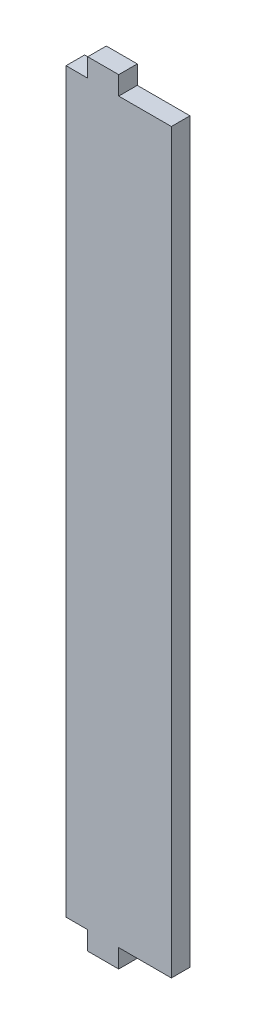
ISO-10303-21;
HEADER;
FILE_DESCRIPTION(('STEP AP214'),'2;1');
FILE_NAME('part.step','',(''),(''),'','','');
FILE_SCHEMA(('AUTOMOTIVE_DESIGN { 1 0 10303 214 1 1 1 1 }'));
ENDSEC;
DATA;
#1=APPLICATION_CONTEXT('core data for automotive mechanical design processes');
#2=APPLICATION_PROTOCOL_DEFINITION('international standard','automotive_design',2000,#1);
#3=PRODUCT_CONTEXT('',#1,'mechanical');
#4=PRODUCT('Part','Part','',(#3));
#5=PRODUCT_RELATED_PRODUCT_CATEGORY('part','',(#4));
#6=PRODUCT_DEFINITION_FORMATION('','',#4);
#7=PRODUCT_DEFINITION_CONTEXT('part definition',#1,'design');
#8=PRODUCT_DEFINITION('design','',#6,#7);
#9=PRODUCT_DEFINITION_SHAPE('','',#8);
#10=(LENGTH_UNIT() NAMED_UNIT(*) SI_UNIT(.MILLI.,.METRE.));
#11=(NAMED_UNIT(*) PLANE_ANGLE_UNIT() SI_UNIT($,.RADIAN.));
#12=(NAMED_UNIT(*) SI_UNIT($,.STERADIAN.) SOLID_ANGLE_UNIT());
#13=UNCERTAINTY_MEASURE_WITH_UNIT(LENGTH_MEASURE(1.E-05),#10,'distance_accuracy_value','');
#14=(GEOMETRIC_REPRESENTATION_CONTEXT(3) GLOBAL_UNCERTAINTY_ASSIGNED_CONTEXT((#13)) GLOBAL_UNIT_ASSIGNED_CONTEXT((#10,
#11,#12)) REPRESENTATION_CONTEXT('',''));
#15=CARTESIAN_POINT('',(0.,0.,0.));
#16=DIRECTION('',(0.,0.,1.));
#17=DIRECTION('',(1.,0.,0.));
#18=AXIS2_PLACEMENT_3D('',#15,#16,#17);
#19=CARTESIAN_POINT('',(-17.,-119.,6.));
#20=DIRECTION('',(0.,1.,0.));
#21=DIRECTION('',(0.,0.,1.));
#22=AXIS2_PLACEMENT_3D('',#19,#20,#21);
#23=PLANE('',#22);
#24=DIRECTION('',(0.,0.,1.));
#25=VECTOR('',#24,1.);
#26=CARTESIAN_POINT('',(0.,-119.,0.));
#27=LINE('',#26,#25);
#28=CARTESIAN_POINT('',(0.,-119.,0.));
#29=VERTEX_POINT('',#28);
#30=CARTESIAN_POINT('',(0.,-119.,6.));
#31=VERTEX_POINT('',#30);
#32=EDGE_CURVE('E243',#29,#31,#27,.T.);
#33=ORIENTED_EDGE('',*,*,#32,.F.);
#34=DIRECTION('',(1.,0.,0.));
#35=VECTOR('',#34,1.);
#36=CARTESIAN_POINT('',(-17.,-119.,0.));
#37=LINE('',#36,#35);
#38=CARTESIAN_POINT('',(17.,-119.,0.));
#39=VERTEX_POINT('',#38);
#40=EDGE_CURVE('E146',#29,#39,#37,.T.);
#41=ORIENTED_EDGE('',*,*,#40,.T.);
#42=DIRECTION('',(0.,0.,-1.));
#43=VECTOR('',#42,1.);
#44=CARTESIAN_POINT('',(17.,-119.,6.));
#45=LINE('',#44,#43);
#46=CARTESIAN_POINT('',(17.,-119.,6.));
#47=VERTEX_POINT('',#46);
#48=EDGE_CURVE('E42',#47,#39,#45,.T.);
#49=ORIENTED_EDGE('',*,*,#48,.F.);
#50=DIRECTION('',(1.,0.,0.));
#51=VECTOR('',#50,1.);
#52=CARTESIAN_POINT('',(-17.,-119.,6.));
#53=LINE('',#52,#51);
#54=EDGE_CURVE('E202',#31,#47,#53,.T.);
#55=ORIENTED_EDGE('',*,*,#54,.F.);
#56=EDGE_LOOP('',(#33,#41,#49,#55));
#57=FACE_BOUND('',#56,.T.);
#58=ADVANCED_FACE('F33',(#57),#23,.F.);
#59=CARTESIAN_POINT('',(-17.,119.,6.));
#60=DIRECTION('',(0.,-1.,0.));
#61=DIRECTION('',(0.,0.,-1.));
#62=AXIS2_PLACEMENT_3D('',#59,#60,#61);
#63=PLANE('',#62);
#64=DIRECTION('',(0.,0.,1.));
#65=VECTOR('',#64,1.);
#66=CARTESIAN_POINT('',(-10.,119.,0.));
#67=LINE('',#66,#65);
#68=CARTESIAN_POINT('',(-10.,119.,0.));
#69=VERTEX_POINT('',#68);
#70=CARTESIAN_POINT('',(-10.,119.,6.));
#71=VERTEX_POINT('',#70);
#72=EDGE_CURVE('E230',#69,#71,#67,.T.);
#73=ORIENTED_EDGE('',*,*,#72,.F.);
#74=DIRECTION('',(-1.,0.,0.));
#75=VECTOR('',#74,1.);
#76=CARTESIAN_POINT('',(-17.,119.,0.));
#77=LINE('',#76,#75);
#78=CARTESIAN_POINT('',(-17.,119.,0.));
#79=VERTEX_POINT('',#78);
#80=EDGE_CURVE('E148',#69,#79,#77,.T.);
#81=ORIENTED_EDGE('',*,*,#80,.T.);
#82=DIRECTION('',(0.,0.,-1.));
#83=VECTOR('',#82,1.);
#84=CARTESIAN_POINT('',(-17.,119.,6.));
#85=LINE('',#84,#83);
#86=CARTESIAN_POINT('',(-17.,119.,6.));
#87=VERTEX_POINT('',#86);
#88=EDGE_CURVE('E164',#87,#79,#85,.T.);
#89=ORIENTED_EDGE('',*,*,#88,.F.);
#90=DIRECTION('',(-1.,0.,0.));
#91=VECTOR('',#90,1.);
#92=CARTESIAN_POINT('',(-17.,119.,6.));
#93=LINE('',#92,#91);
#94=EDGE_CURVE('E187',#71,#87,#93,.T.);
#95=ORIENTED_EDGE('',*,*,#94,.F.);
#96=EDGE_LOOP('',(#73,#81,#89,#95));
#97=FACE_BOUND('',#96,.T.);
#98=ADVANCED_FACE('F293',(#97),#63,.F.);
#99=CARTESIAN_POINT('',(-17.,119.,6.));
#100=DIRECTION('',(1.,0.,0.));
#101=DIRECTION('',(0.,1.,0.));
#102=AXIS2_PLACEMENT_3D('',#99,#100,#101);
#103=PLANE('',#102);
#104=DIRECTION('',(0.,-1.,0.));
#105=VECTOR('',#104,1.);
#106=CARTESIAN_POINT('',(-17.,119.,0.));
#107=LINE('',#106,#105);
#108=CARTESIAN_POINT('',(-17.,-119.,0.));
#109=VERTEX_POINT('',#108);
#110=EDGE_CURVE('E150',#79,#109,#107,.T.);
#111=ORIENTED_EDGE('',*,*,#110,.T.);
#112=DIRECTION('',(0.,0.,-1.));
#113=VECTOR('',#112,1.);
#114=CARTESIAN_POINT('',(-17.,-119.,6.));
#115=LINE('',#114,#113);
#116=CARTESIAN_POINT('',(-17.,-119.,6.));
#117=VERTEX_POINT('',#116);
#118=EDGE_CURVE('E11',#117,#109,#115,.T.);
#119=ORIENTED_EDGE('',*,*,#118,.F.);
#120=DIRECTION('',(0.,-1.,0.));
#121=VECTOR('',#120,1.);
#122=CARTESIAN_POINT('',(-17.,119.,6.));
#123=LINE('',#122,#121);
#124=EDGE_CURVE('E172',#87,#117,#123,.T.);
#125=ORIENTED_EDGE('',*,*,#124,.F.);
#126=ORIENTED_EDGE('',*,*,#88,.T.);
#127=EDGE_LOOP('',(#111,#119,#125,#126));
#128=FACE_BOUND('',#127,.T.);
#129=ADVANCED_FACE('F35',(#128),#103,.F.);
#130=CARTESIAN_POINT('',(-9.99999999999999,-119.,0.));
#131=VERTEX_POINT('',#130);
#132=EDGE_CURVE('E136',#109,#131,#37,.T.);
#133=ORIENTED_EDGE('',*,*,#132,.T.);
#134=DIRECTION('',(0.,0.,1.));
#135=VECTOR('',#134,1.);
#136=CARTESIAN_POINT('',(-9.99999999999999,-119.,0.));
#137=LINE('',#136,#135);
#138=CARTESIAN_POINT('',(-9.99999999999999,-119.,6.));
#139=VERTEX_POINT('',#138);
#140=EDGE_CURVE('E122',#131,#139,#137,.T.);
#141=ORIENTED_EDGE('',*,*,#140,.T.);
#142=EDGE_CURVE('E196',#117,#139,#53,.T.);
#143=ORIENTED_EDGE('',*,*,#142,.F.);
#144=ORIENTED_EDGE('',*,*,#118,.T.);
#145=EDGE_LOOP('',(#133,#141,#143,#144));
#146=FACE_BOUND('',#145,.T.);
#147=ADVANCED_FACE('F142',(#146),#23,.F.);
#148=CARTESIAN_POINT('',(17.,119.,6.));
#149=DIRECTION('',(-1.,0.,0.));
#150=DIRECTION('',(0.,-1.,0.));
#151=AXIS2_PLACEMENT_3D('',#148,#149,#150);
#152=PLANE('',#151);
#153=DIRECTION('',(0.,1.,0.));
#154=VECTOR('',#153,1.);
#155=CARTESIAN_POINT('',(17.,119.,0.));
#156=LINE('',#155,#154);
#157=CARTESIAN_POINT('',(17.,119.,0.));
#158=VERTEX_POINT('',#157);
#159=EDGE_CURVE('E145',#39,#158,#156,.T.);
#160=ORIENTED_EDGE('',*,*,#159,.T.);
#161=DIRECTION('',(0.,0.,-1.));
#162=VECTOR('',#161,1.);
#163=CARTESIAN_POINT('',(17.,119.,6.));
#164=LINE('',#163,#162);
#165=CARTESIAN_POINT('',(17.,119.,6.));
#166=VERTEX_POINT('',#165);
#167=EDGE_CURVE('E175',#166,#158,#164,.T.);
#168=ORIENTED_EDGE('',*,*,#167,.F.);
#169=DIRECTION('',(0.,1.,0.));
#170=VECTOR('',#169,1.);
#171=CARTESIAN_POINT('',(17.,119.,6.));
#172=LINE('',#171,#170);
#173=EDGE_CURVE('E189',#47,#166,#172,.T.);
#174=ORIENTED_EDGE('',*,*,#173,.F.);
#175=ORIENTED_EDGE('',*,*,#48,.T.);
#176=EDGE_LOOP('',(#160,#168,#174,#175));
#177=FACE_BOUND('',#176,.T.);
#178=ADVANCED_FACE('F273',(#177),#152,.F.);
#179=CARTESIAN_POINT('',(0.,119.,0.));
#180=VERTEX_POINT('',#179);
#181=EDGE_CURVE('E170',#158,#180,#77,.T.);
#182=ORIENTED_EDGE('',*,*,#181,.T.);
#183=DIRECTION('',(0.,0.,1.));
#184=VECTOR('',#183,1.);
#185=CARTESIAN_POINT('',(0.,119.,0.));
#186=LINE('',#185,#184);
#187=CARTESIAN_POINT('',(0.,119.,6.));
#188=VERTEX_POINT('',#187);
#189=EDGE_CURVE('E219',#180,#188,#186,.T.);
#190=ORIENTED_EDGE('',*,*,#189,.T.);
#191=EDGE_CURVE('E182',#166,#188,#93,.T.);
#192=ORIENTED_EDGE('',*,*,#191,.F.);
#193=ORIENTED_EDGE('',*,*,#167,.T.);
#194=EDGE_LOOP('',(#182,#190,#192,#193));
#195=FACE_BOUND('',#194,.T.);
#196=ADVANCED_FACE('F274',(#195),#63,.F.);
#197=CARTESIAN_POINT('',(0.,0.,6.));
#198=DIRECTION('',(0.,0.,1.));
#199=DIRECTION('',(1.,0.,0.));
#200=AXIS2_PLACEMENT_3D('',#197,#198,#199);
#201=PLANE('',#200);
#202=ORIENTED_EDGE('',*,*,#124,.T.);
#203=ORIENTED_EDGE('',*,*,#142,.T.);
#204=DIRECTION('',(0.,-1.,0.));
#205=VECTOR('',#204,1.);
#206=CARTESIAN_POINT('',(-9.99999999999999,-119.,6.));
#207=LINE('',#206,#205);
#208=CARTESIAN_POINT('',(-9.99999999999998,-125.,6.));
#209=VERTEX_POINT('',#208);
#210=EDGE_CURVE('E50',#139,#209,#207,.T.);
#211=ORIENTED_EDGE('',*,*,#210,.T.);
#212=DIRECTION('',(1.,0.,0.));
#213=VECTOR('',#212,1.);
#214=CARTESIAN_POINT('',(-9.99999999999998,-125.,6.));
#215=LINE('',#214,#213);
#216=CARTESIAN_POINT('',(0.,-125.,6.));
#217=VERTEX_POINT('',#216);
#218=EDGE_CURVE('E258',#209,#217,#215,.T.);
#219=ORIENTED_EDGE('',*,*,#218,.T.);
#220=DIRECTION('',(0.,1.,0.));
#221=VECTOR('',#220,1.);
#222=CARTESIAN_POINT('',(0.,-119.,6.));
#223=LINE('',#222,#221);
#224=EDGE_CURVE('E140',#217,#31,#223,.T.);
#225=ORIENTED_EDGE('',*,*,#224,.T.);
#226=ORIENTED_EDGE('',*,*,#54,.T.);
#227=ORIENTED_EDGE('',*,*,#173,.T.);
#228=ORIENTED_EDGE('',*,*,#191,.T.);
#229=DIRECTION('',(0.,1.,0.));
#230=VECTOR('',#229,1.);
#231=CARTESIAN_POINT('',(0.,119.,6.));
#232=LINE('',#231,#230);
#233=CARTESIAN_POINT('',(0.,125.,6.));
#234=VERTEX_POINT('',#233);
#235=EDGE_CURVE('E58',#188,#234,#232,.T.);
#236=ORIENTED_EDGE('',*,*,#235,.T.);
#237=DIRECTION('',(-1.,0.,0.));
#238=VECTOR('',#237,1.);
#239=CARTESIAN_POINT('',(-10.,125.,6.));
#240=LINE('',#239,#238);
#241=CARTESIAN_POINT('',(-10.,125.,6.));
#242=VERTEX_POINT('',#241);
#243=EDGE_CURVE('E222',#234,#242,#240,.T.);
#244=ORIENTED_EDGE('',*,*,#243,.T.);
#245=DIRECTION('',(0.,-1.,0.));
#246=VECTOR('',#245,1.);
#247=CARTESIAN_POINT('',(-10.,119.,6.));
#248=LINE('',#247,#246);
#249=EDGE_CURVE('E242',#242,#71,#248,.T.);
#250=ORIENTED_EDGE('',*,*,#249,.T.);
#251=ORIENTED_EDGE('',*,*,#94,.T.);
#252=EDGE_LOOP('',(#202,#203,#211,#219,#225,#226,#227,#228,#236,#244,#250,#251));
#253=FACE_BOUND('',#252,.T.);
#254=ADVANCED_FACE('F208',(#253),#201,.T.);
#255=CARTESIAN_POINT('',(0.,0.,0.));
#256=DIRECTION('',(0.,0.,1.));
#257=DIRECTION('',(1.,0.,0.));
#258=AXIS2_PLACEMENT_3D('',#255,#256,#257);
#259=PLANE('',#258);
#260=ORIENTED_EDGE('',*,*,#110,.F.);
#261=ORIENTED_EDGE('',*,*,#80,.F.);
#262=DIRECTION('',(0.,-1.,0.));
#263=VECTOR('',#262,1.);
#264=CARTESIAN_POINT('',(-10.,119.,0.));
#265=LINE('',#264,#263);
#266=CARTESIAN_POINT('',(-10.,125.,0.));
#267=VERTEX_POINT('',#266);
#268=EDGE_CURVE('E236',#267,#69,#265,.T.);
#269=ORIENTED_EDGE('',*,*,#268,.F.);
#270=DIRECTION('',(-1.,0.,0.));
#271=VECTOR('',#270,1.);
#272=CARTESIAN_POINT('',(-10.,125.,0.));
#273=LINE('',#272,#271);
#274=CARTESIAN_POINT('',(0.,125.,0.));
#275=VERTEX_POINT('',#274);
#276=EDGE_CURVE('E235',#275,#267,#273,.T.);
#277=ORIENTED_EDGE('',*,*,#276,.F.);
#278=DIRECTION('',(0.,1.,0.));
#279=VECTOR('',#278,1.);
#280=CARTESIAN_POINT('',(0.,119.,0.));
#281=LINE('',#280,#279);
#282=EDGE_CURVE('E232',#180,#275,#281,.T.);
#283=ORIENTED_EDGE('',*,*,#282,.F.);
#284=ORIENTED_EDGE('',*,*,#181,.F.);
#285=ORIENTED_EDGE('',*,*,#159,.F.);
#286=ORIENTED_EDGE('',*,*,#40,.F.);
#287=DIRECTION('',(0.,1.,0.));
#288=VECTOR('',#287,1.);
#289=CARTESIAN_POINT('',(0.,-119.,0.));
#290=LINE('',#289,#288);
#291=CARTESIAN_POINT('',(0.,-125.,0.));
#292=VERTEX_POINT('',#291);
#293=EDGE_CURVE('E130',#292,#29,#290,.T.);
#294=ORIENTED_EDGE('',*,*,#293,.F.);
#295=DIRECTION('',(1.,0.,0.));
#296=VECTOR('',#295,1.);
#297=CARTESIAN_POINT('',(-9.99999999999998,-125.,0.));
#298=LINE('',#297,#296);
#299=CARTESIAN_POINT('',(-9.99999999999998,-125.,0.));
#300=VERTEX_POINT('',#299);
#301=EDGE_CURVE('E139',#300,#292,#298,.T.);
#302=ORIENTED_EDGE('',*,*,#301,.F.);
#303=DIRECTION('',(0.,-1.,0.));
#304=VECTOR('',#303,1.);
#305=CARTESIAN_POINT('',(-9.99999999999999,-119.,0.));
#306=LINE('',#305,#304);
#307=EDGE_CURVE('E125',#131,#300,#306,.T.);
#308=ORIENTED_EDGE('',*,*,#307,.F.);
#309=ORIENTED_EDGE('',*,*,#132,.F.);
#310=EDGE_LOOP('',(#260,#261,#269,#277,#283,#284,#285,#286,#294,#302,#308,#309));
#311=FACE_BOUND('',#310,.T.);
#312=ADVANCED_FACE('F135',(#311),#259,.F.);
#313=CARTESIAN_POINT('',(-10.,119.,0.));
#314=DIRECTION('',(-1.,0.,0.));
#315=DIRECTION('',(0.,0.,1.));
#316=AXIS2_PLACEMENT_3D('',#313,#314,#315);
#317=PLANE('',#316);
#318=ORIENTED_EDGE('',*,*,#249,.F.);
#319=DIRECTION('',(0.,0.,1.));
#320=VECTOR('',#319,1.);
#321=CARTESIAN_POINT('',(-10.,125.,0.));
#322=LINE('',#321,#320);
#323=EDGE_CURVE('E212',#267,#242,#322,.T.);
#324=ORIENTED_EDGE('',*,*,#323,.F.);
#325=ORIENTED_EDGE('',*,*,#268,.T.);
#326=ORIENTED_EDGE('',*,*,#72,.T.);
#327=EDGE_LOOP('',(#318,#324,#325,#326));
#328=FACE_BOUND('',#327,.T.);
#329=ADVANCED_FACE('F281',(#328),#317,.T.);
#330=CARTESIAN_POINT('',(-10.,125.,0.));
#331=DIRECTION('',(0.,1.,0.));
#332=DIRECTION('',(0.,0.,1.));
#333=AXIS2_PLACEMENT_3D('',#330,#331,#332);
#334=PLANE('',#333);
#335=ORIENTED_EDGE('',*,*,#243,.F.);
#336=DIRECTION('',(0.,0.,1.));
#337=VECTOR('',#336,1.);
#338=CARTESIAN_POINT('',(0.,125.,0.));
#339=LINE('',#338,#337);
#340=EDGE_CURVE('E213',#275,#234,#339,.T.);
#341=ORIENTED_EDGE('',*,*,#340,.F.);
#342=ORIENTED_EDGE('',*,*,#276,.T.);
#343=ORIENTED_EDGE('',*,*,#323,.T.);
#344=EDGE_LOOP('',(#335,#341,#342,#343));
#345=FACE_BOUND('',#344,.T.);
#346=ADVANCED_FACE('F279',(#345),#334,.T.);
#347=CARTESIAN_POINT('',(0.,119.,0.));
#348=DIRECTION('',(1.,0.,0.));
#349=DIRECTION('',(0.,0.,-1.));
#350=AXIS2_PLACEMENT_3D('',#347,#348,#349);
#351=PLANE('',#350);
#352=ORIENTED_EDGE('',*,*,#235,.F.);
#353=ORIENTED_EDGE('',*,*,#189,.F.);
#354=ORIENTED_EDGE('',*,*,#282,.T.);
#355=ORIENTED_EDGE('',*,*,#340,.T.);
#356=EDGE_LOOP('',(#352,#353,#354,#355));
#357=FACE_BOUND('',#356,.T.);
#358=ADVANCED_FACE('F276',(#357),#351,.T.);
#359=CARTESIAN_POINT('',(0.,-119.,0.));
#360=DIRECTION('',(1.,0.,0.));
#361=DIRECTION('',(0.,1.,0.));
#362=AXIS2_PLACEMENT_3D('',#359,#360,#361);
#363=PLANE('',#362);
#364=ORIENTED_EDGE('',*,*,#224,.F.);
#365=DIRECTION('',(0.,0.,1.));
#366=VECTOR('',#365,1.);
#367=CARTESIAN_POINT('',(0.,-125.,0.));
#368=LINE('',#367,#366);
#369=EDGE_CURVE('E245',#292,#217,#368,.T.);
#370=ORIENTED_EDGE('',*,*,#369,.F.);
#371=ORIENTED_EDGE('',*,*,#293,.T.);
#372=ORIENTED_EDGE('',*,*,#32,.T.);
#373=EDGE_LOOP('',(#364,#370,#371,#372));
#374=FACE_BOUND('',#373,.T.);
#375=ADVANCED_FACE('F287',(#374),#363,.T.);
#376=CARTESIAN_POINT('',(-9.99999999999998,-125.,0.));
#377=DIRECTION('',(0.,-1.,0.));
#378=DIRECTION('',(0.,0.,-1.));
#379=AXIS2_PLACEMENT_3D('',#376,#377,#378);
#380=PLANE('',#379);
#381=ORIENTED_EDGE('',*,*,#218,.F.);
#382=DIRECTION('',(0.,0.,1.));
#383=VECTOR('',#382,1.);
#384=CARTESIAN_POINT('',(-9.99999999999998,-125.,0.));
#385=LINE('',#384,#383);
#386=EDGE_CURVE('E129',#300,#209,#385,.T.);
#387=ORIENTED_EDGE('',*,*,#386,.F.);
#388=ORIENTED_EDGE('',*,*,#301,.T.);
#389=ORIENTED_EDGE('',*,*,#369,.T.);
#390=EDGE_LOOP('',(#381,#387,#388,#389));
#391=FACE_BOUND('',#390,.T.);
#392=ADVANCED_FACE('F371',(#391),#380,.T.);
#393=CARTESIAN_POINT('',(-9.99999999999999,-119.,0.));
#394=DIRECTION('',(-1.,0.,0.));
#395=DIRECTION('',(0.,-1.,0.));
#396=AXIS2_PLACEMENT_3D('',#393,#394,#395);
#397=PLANE('',#396);
#398=ORIENTED_EDGE('',*,*,#210,.F.);
#399=ORIENTED_EDGE('',*,*,#140,.F.);
#400=ORIENTED_EDGE('',*,*,#307,.T.);
#401=ORIENTED_EDGE('',*,*,#386,.T.);
#402=EDGE_LOOP('',(#398,#399,#400,#401));
#403=FACE_BOUND('',#402,.T.);
#404=ADVANCED_FACE('F124',(#403),#397,.T.);
#405=CLOSED_SHELL('',(#58,#98,#129,#147,#178,#196,#254,#312,#329,#346,#358,#375,#392,#404));
#406=MANIFOLD_SOLID_BREP('B2',#405);
#407=ADVANCED_BREP_SHAPE_REPRESENTATION('',(#18,#406),#14);
#408=SHAPE_DEFINITION_REPRESENTATION(#9,#407);
ENDSEC;
END-ISO-10303-21;
